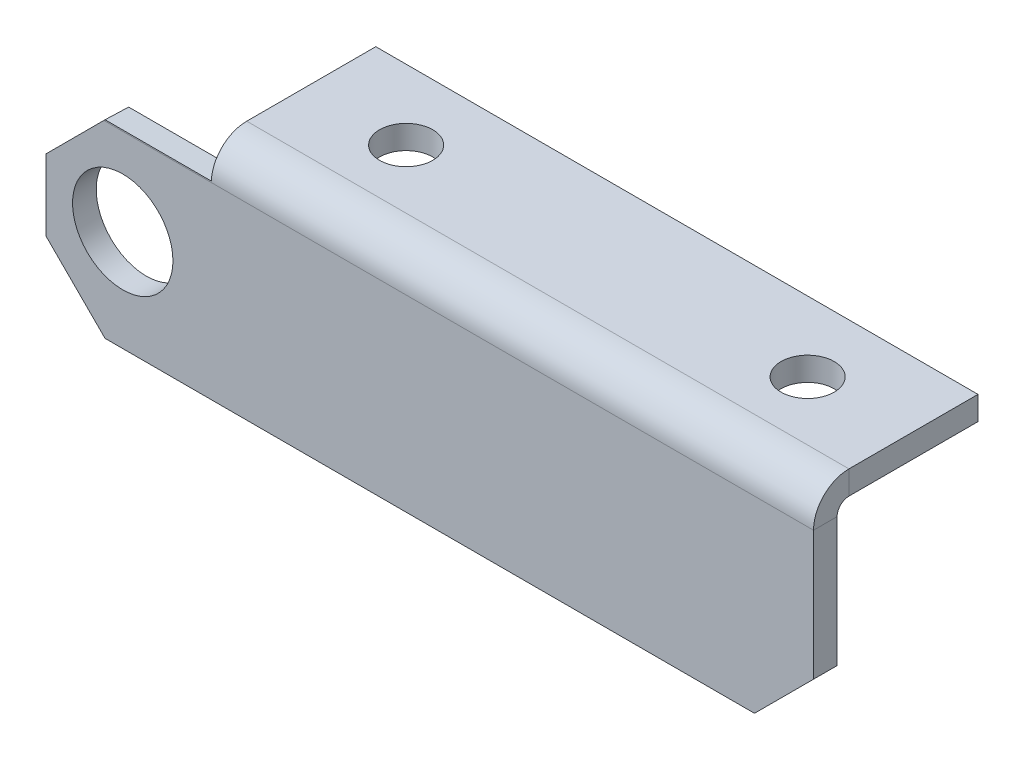
ISO-10303-21;
HEADER;
FILE_DESCRIPTION(('STEP AP214'),'2;1');
FILE_NAME('part.step','',(''),(''),'','','');
FILE_SCHEMA(('AUTOMOTIVE_DESIGN { 1 0 10303 214 1 1 1 1 }'));
ENDSEC;
DATA;
#1=APPLICATION_CONTEXT('core data for automotive mechanical design processes');
#2=APPLICATION_PROTOCOL_DEFINITION('international standard','automotive_design',2000,#1);
#3=PRODUCT_CONTEXT('',#1,'mechanical');
#4=PRODUCT('Part','Part','',(#3));
#5=PRODUCT_RELATED_PRODUCT_CATEGORY('part','',(#4));
#6=PRODUCT_DEFINITION_FORMATION('','',#4);
#7=PRODUCT_DEFINITION_CONTEXT('part definition',#1,'design');
#8=PRODUCT_DEFINITION('design','',#6,#7);
#9=PRODUCT_DEFINITION_SHAPE('','',#8);
#10=(LENGTH_UNIT() NAMED_UNIT(*) SI_UNIT(.MILLI.,.METRE.));
#11=(NAMED_UNIT(*) PLANE_ANGLE_UNIT() SI_UNIT($,.RADIAN.));
#12=(NAMED_UNIT(*) SI_UNIT($,.STERADIAN.) SOLID_ANGLE_UNIT());
#13=UNCERTAINTY_MEASURE_WITH_UNIT(LENGTH_MEASURE(1.E-05),#10,'distance_accuracy_value','');
#14=(GEOMETRIC_REPRESENTATION_CONTEXT(3) GLOBAL_UNCERTAINTY_ASSIGNED_CONTEXT((#13)) GLOBAL_UNIT_ASSIGNED_CONTEXT((#10,
#11,#12)) REPRESENTATION_CONTEXT('',''));
#15=CARTESIAN_POINT('',(0.,0.,0.));
#16=DIRECTION('',(0.,0.,1.));
#17=DIRECTION('',(1.,0.,0.));
#18=AXIS2_PLACEMENT_3D('',#15,#16,#17);
#19=CARTESIAN_POINT('',(0.,18.9292036732052,18.0707963267949));
#20=DIRECTION('',(0.,1.,0.));
#21=DIRECTION('',(1.,0.,0.));
#22=AXIS2_PLACEMENT_3D('',#19,#20,#21);
#23=PLANE('',#22);
#24=CARTESIAN_POINT('',(22.5,18.9292036732052,-6.00000000000007));
#25=DIRECTION('',(0.,-1.,0.));
#26=DIRECTION('',(0.,0.,-1.));
#27=AXIS2_PLACEMENT_3D('',#24,#25,#26);
#28=CIRCLE('',#27,2.25);
#29=CARTESIAN_POINT('',(22.5,18.9292036732052,-8.25000000000007));
#30=VERTEX_POINT('',#29);
#31=EDGE_CURVE('E473',#30,#30,#28,.T.);
#32=ORIENTED_EDGE('',*,*,#31,.T.);
#33=EDGE_LOOP('',(#32));
#34=FACE_BOUND('',#33,.T.);
#35=CARTESIAN_POINT('',(56.5000000000001,18.9292036732052,-5.99999999999995));
#36=DIRECTION('',(0.,-1.,0.));
#37=DIRECTION('',(0.,0.,-1.));
#38=AXIS2_PLACEMENT_3D('',#35,#36,#37);
#39=CIRCLE('',#38,2.25);
#40=CARTESIAN_POINT('',(56.5000000000001,18.9292036732051,-8.24999999999995));
#41=VERTEX_POINT('',#40);
#42=EDGE_CURVE('E468',#41,#41,#39,.T.);
#43=ORIENTED_EDGE('',*,*,#42,.T.);
#44=EDGE_LOOP('',(#43));
#45=FACE_BOUND('',#44,.T.);
#46=DIRECTION('',(0.,0.,1.));
#47=VECTOR('',#46,1.);
#48=CARTESIAN_POINT('',(14.,18.9292036732051,-11.9292036732051));
#49=LINE('',#48,#47);
#50=CARTESIAN_POINT('',(14.,18.9292036732051,-11.9292036732051));
#51=VERTEX_POINT('',#50);
#52=CARTESIAN_POINT('',(14.,18.9292036732051,-1.00000000000001));
#53=VERTEX_POINT('',#52);
#54=EDGE_CURVE('E196',#51,#53,#49,.T.);
#55=ORIENTED_EDGE('',*,*,#54,.T.);
#56=DIRECTION('',(1.,0.,0.));
#57=VECTOR('',#56,1.);
#58=CARTESIAN_POINT('',(0.,18.9292036732051,-1.00000000000001));
#59=LINE('',#58,#57);
#60=CARTESIAN_POINT('',(65.0000000000001,18.9292036732052,-0.99999999999989));
#61=VERTEX_POINT('',#60);
#62=EDGE_CURVE('E209',#53,#61,#59,.T.);
#63=ORIENTED_EDGE('',*,*,#62,.T.);
#64=DIRECTION('',(0.,0.,-1.));
#65=VECTOR('',#64,1.);
#66=CARTESIAN_POINT('',(65.0000000000001,18.9292036732052,18.0707963267949));
#67=LINE('',#66,#65);
#68=CARTESIAN_POINT('',(65.0000000000001,18.9292036732051,-11.929203673205));
#69=VERTEX_POINT('',#68);
#70=EDGE_CURVE('E192',#61,#69,#67,.T.);
#71=ORIENTED_EDGE('',*,*,#70,.T.);
#72=DIRECTION('',(-1.,0.,0.));
#73=VECTOR('',#72,1.);
#74=CARTESIAN_POINT('',(65.0000000000001,18.9292036732051,-11.929203673205));
#75=LINE('',#74,#73);
#76=EDGE_CURVE('E194',#69,#51,#75,.T.);
#77=ORIENTED_EDGE('',*,*,#76,.T.);
#78=EDGE_LOOP('',(#55,#63,#71,#77));
#79=FACE_BOUND('',#78,.T.);
#80=ADVANCED_FACE('F30',(#34,#45,#79),#23,.T.);
#81=CARTESIAN_POINT('',(65.0000000000001,18.9292036732052,18.0707963267949));
#82=DIRECTION('',(-1.,0.,0.));
#83=DIRECTION('',(0.,1.,0.));
#84=AXIS2_PLACEMENT_3D('',#81,#82,#83);
#85=PLANE('',#84);
#86=DIRECTION('',(0.,1.,0.));
#87=VECTOR('',#86,1.);
#88=CARTESIAN_POINT('',(65.0000000000001,18.9292036732052,-0.99999999999989));
#89=LINE('',#88,#87);
#90=CARTESIAN_POINT('',(65.,16.9292036732052,-0.999999999999918));
#91=VERTEX_POINT('',#90);
#92=EDGE_CURVE('E205',#91,#61,#89,.T.);
#93=ORIENTED_EDGE('',*,*,#92,.F.);
#94=DIRECTION('',(0.,0.,-1.));
#95=VECTOR('',#94,1.);
#96=CARTESIAN_POINT('',(65.,16.9292036732052,18.070796326795));
#97=LINE('',#96,#95);
#98=CARTESIAN_POINT('',(65.0000000000001,16.9292036732051,-11.929203673205));
#99=VERTEX_POINT('',#98);
#100=EDGE_CURVE('E186',#91,#99,#97,.T.);
#101=ORIENTED_EDGE('',*,*,#100,.T.);
#102=DIRECTION('',(0.,-1.,0.));
#103=VECTOR('',#102,1.);
#104=CARTESIAN_POINT('',(65.0000000000001,18.9292036732051,-11.929203673205));
#105=LINE('',#104,#103);
#106=EDGE_CURVE('E202',#69,#99,#105,.T.);
#107=ORIENTED_EDGE('',*,*,#106,.F.);
#108=ORIENTED_EDGE('',*,*,#70,.F.);
#109=EDGE_LOOP('',(#93,#101,#107,#108));
#110=FACE_BOUND('',#109,.T.);
#111=ADVANCED_FACE('F32',(#110),#85,.F.);
#112=CARTESIAN_POINT('',(65.0000000000001,18.9292036732051,-11.929203673205));
#113=DIRECTION('',(0.,0.,1.));
#114=DIRECTION('',(1.,0.,0.));
#115=AXIS2_PLACEMENT_3D('',#112,#113,#114);
#116=PLANE('',#115);
#117=DIRECTION('',(-1.,0.,0.));
#118=VECTOR('',#117,1.);
#119=CARTESIAN_POINT('',(65.0000000000001,16.9292036732051,-11.929203673205));
#120=LINE('',#119,#118);
#121=CARTESIAN_POINT('',(14.,16.9292036732051,-11.9292036732051));
#122=VERTEX_POINT('',#121);
#123=EDGE_CURVE('E188',#99,#122,#120,.T.);
#124=ORIENTED_EDGE('',*,*,#123,.T.);
#125=DIRECTION('',(0.,-1.,0.));
#126=VECTOR('',#125,1.);
#127=CARTESIAN_POINT('',(14.,18.9292036732051,-11.9292036732051));
#128=LINE('',#127,#126);
#129=EDGE_CURVE('E199',#51,#122,#128,.T.);
#130=ORIENTED_EDGE('',*,*,#129,.F.);
#131=ORIENTED_EDGE('',*,*,#76,.F.);
#132=ORIENTED_EDGE('',*,*,#106,.T.);
#133=EDGE_LOOP('',(#124,#130,#131,#132));
#134=FACE_BOUND('',#133,.T.);
#135=ADVANCED_FACE('F261',(#134),#116,.F.);
#136=CARTESIAN_POINT('',(14.,18.9292036732051,-11.9292036732051));
#137=DIRECTION('',(1.,0.,0.));
#138=DIRECTION('',(0.,0.,-1.));
#139=AXIS2_PLACEMENT_3D('',#136,#137,#138);
#140=PLANE('',#139);
#141=DIRECTION('',(0.,-1.,0.));
#142=VECTOR('',#141,1.);
#143=CARTESIAN_POINT('',(14.,18.9292036732051,-1.00000000000001));
#144=LINE('',#143,#142);
#145=CARTESIAN_POINT('',(14.,16.9292036732051,-1.00000000000004));
#146=VERTEX_POINT('',#145);
#147=EDGE_CURVE('E152',#53,#146,#144,.T.);
#148=ORIENTED_EDGE('',*,*,#147,.F.);
#149=ORIENTED_EDGE('',*,*,#54,.F.);
#150=ORIENTED_EDGE('',*,*,#129,.T.);
#151=DIRECTION('',(0.,0.,1.));
#152=VECTOR('',#151,1.);
#153=CARTESIAN_POINT('',(14.,16.9292036732051,-11.9292036732051));
#154=LINE('',#153,#152);
#155=EDGE_CURVE('E190',#122,#146,#154,.T.);
#156=ORIENTED_EDGE('',*,*,#155,.T.);
#157=EDGE_LOOP('',(#148,#149,#150,#156));
#158=FACE_BOUND('',#157,.T.);
#159=ADVANCED_FACE('F305',(#158),#140,.F.);
#160=CARTESIAN_POINT('',(0.,16.9292036732052,18.0707963267949));
#161=DIRECTION('',(0.,1.,0.));
#162=DIRECTION('',(1.,0.,0.));
#163=AXIS2_PLACEMENT_3D('',#160,#161,#162);
#164=PLANE('',#163);
#165=CARTESIAN_POINT('',(22.5,16.9292036732051,-6.00000000000007));
#166=DIRECTION('',(0.,-1.,0.));
#167=DIRECTION('',(0.,0.,-1.));
#168=AXIS2_PLACEMENT_3D('',#165,#166,#167);
#169=CIRCLE('',#168,2.25);
#170=CARTESIAN_POINT('',(22.5,16.9292036732051,-8.25000000000007));
#171=VERTEX_POINT('',#170);
#172=EDGE_CURVE('E477',#171,#171,#169,.T.);
#173=ORIENTED_EDGE('',*,*,#172,.F.);
#174=EDGE_LOOP('',(#173));
#175=FACE_BOUND('',#174,.T.);
#176=CARTESIAN_POINT('',(56.5000000000001,16.9292036732051,-5.99999999999998));
#177=DIRECTION('',(0.,-1.,0.));
#178=DIRECTION('',(0.,0.,-1.));
#179=AXIS2_PLACEMENT_3D('',#176,#177,#178);
#180=CIRCLE('',#179,2.25);
#181=CARTESIAN_POINT('',(56.5000000000001,16.9292036732051,-8.24999999999998));
#182=VERTEX_POINT('',#181);
#183=EDGE_CURVE('E471',#182,#182,#180,.T.);
#184=ORIENTED_EDGE('',*,*,#183,.F.);
#185=EDGE_LOOP('',(#184));
#186=FACE_BOUND('',#185,.T.);
#187=DIRECTION('',(1.,0.,0.));
#188=VECTOR('',#187,1.);
#189=CARTESIAN_POINT('',(0.,16.9292036732051,-1.));
#190=LINE('',#189,#188);
#191=EDGE_CURVE('E211',#146,#91,#190,.T.);
#192=ORIENTED_EDGE('',*,*,#191,.F.);
#193=ORIENTED_EDGE('',*,*,#155,.F.);
#194=ORIENTED_EDGE('',*,*,#123,.F.);
#195=ORIENTED_EDGE('',*,*,#100,.F.);
#196=EDGE_LOOP('',(#192,#193,#194,#195));
#197=FACE_BOUND('',#196,.T.);
#198=ADVANCED_FACE('F254',(#175,#186,#197),#164,.F.);
#199=CARTESIAN_POINT('',(0.,16.,2.));
#200=DIRECTION('',(1.,0.,0.));
#201=DIRECTION('',(0.,1.,0.));
#202=AXIS2_PLACEMENT_3D('',#199,#200,#201);
#203=PLANE('',#202);
#204=DIRECTION('',(0.,-1.,0.));
#205=VECTOR('',#204,1.);
#206=CARTESIAN_POINT('',(0.,16.,2.));
#207=LINE('',#206,#205);
#208=CARTESIAN_POINT('',(0.,11.0323083293317,2.00000000000009));
#209=VERTEX_POINT('',#208);
#210=CARTESIAN_POINT('',(0.,5.00000000000004,2.00000000000009));
#211=VERTEX_POINT('',#210);
#212=EDGE_CURVE('E170',#209,#211,#207,.T.);
#213=ORIENTED_EDGE('',*,*,#212,.F.);
#214=DIRECTION('',(0.,-0.0353907713673031,-0.999373550431483));
#215=VECTOR('',#214,1.);
#216=CARTESIAN_POINT('',(0.,10.967726692415,0.176327407268084));
#217=LINE('',#216,#215);
#218=CARTESIAN_POINT('',(0.,10.9614824177354,0.));
#219=VERTEX_POINT('',#218);
#220=EDGE_CURVE('E223',#209,#219,#217,.T.);
#221=ORIENTED_EDGE('',*,*,#220,.T.);
#222=DIRECTION('',(0.,-1.,0.));
#223=VECTOR('',#222,1.);
#224=CARTESIAN_POINT('',(0.,16.,0.));
#225=LINE('',#224,#223);
#226=CARTESIAN_POINT('',(0.,5.00000000000005,0.));
#227=VERTEX_POINT('',#226);
#228=EDGE_CURVE('E137',#219,#227,#225,.T.);
#229=ORIENTED_EDGE('',*,*,#228,.T.);
#230=DIRECTION('',(0.,0.,1.));
#231=VECTOR('',#230,1.);
#232=CARTESIAN_POINT('',(0.,5.00000000000006,2.00000000000009));
#233=LINE('',#232,#231);
#234=EDGE_CURVE('E221',#227,#211,#233,.T.);
#235=ORIENTED_EDGE('',*,*,#234,.T.);
#236=EDGE_LOOP('',(#213,#221,#229,#235));
#237=FACE_BOUND('',#236,.T.);
#238=ADVANCED_FACE('F277',(#237),#203,.F.);
#239=CARTESIAN_POINT('',(65.0000000000001,0.,2.));
#240=DIRECTION('',(-1.,0.,0.));
#241=DIRECTION('',(0.,0.,1.));
#242=AXIS2_PLACEMENT_3D('',#239,#240,#241);
#243=PLANE('',#242);
#244=DIRECTION('',(0.,1.,0.));
#245=VECTOR('',#244,1.);
#246=CARTESIAN_POINT('',(65.0000000000001,0.,2.));
#247=LINE('',#246,#245);
#248=CARTESIAN_POINT('',(65.0000000000001,5.00000000000001,2.));
#249=VERTEX_POINT('',#248);
#250=CARTESIAN_POINT('',(65.0000000000001,15.9292036732051,2.00000000000009));
#251=VERTEX_POINT('',#250);
#252=EDGE_CURVE('E175',#249,#251,#247,.T.);
#253=ORIENTED_EDGE('',*,*,#252,.F.);
#254=DIRECTION('',(0.,0.,-1.));
#255=VECTOR('',#254,1.);
#256=CARTESIAN_POINT('',(65.0000000000001,5.00000000000001,2.));
#257=LINE('',#256,#255);
#258=CARTESIAN_POINT('',(65.0000000000001,5.,0.));
#259=VERTEX_POINT('',#258);
#260=EDGE_CURVE('E233',#249,#259,#257,.T.);
#261=ORIENTED_EDGE('',*,*,#260,.T.);
#262=DIRECTION('',(0.,1.,0.));
#263=VECTOR('',#262,1.);
#264=CARTESIAN_POINT('',(65.0000000000001,0.,0.));
#265=LINE('',#264,#263);
#266=CARTESIAN_POINT('',(65.0000000000001,15.9292036732052,0.));
#267=VERTEX_POINT('',#266);
#268=EDGE_CURVE('E168',#259,#267,#265,.T.);
#269=ORIENTED_EDGE('',*,*,#268,.T.);
#270=DIRECTION('',(0.,0.,1.));
#271=VECTOR('',#270,1.);
#272=CARTESIAN_POINT('',(65.0000000000001,15.9292036732051,2.00000000000009));
#273=LINE('',#272,#271);
#274=EDGE_CURVE('E180',#267,#251,#273,.T.);
#275=ORIENTED_EDGE('',*,*,#274,.T.);
#276=EDGE_LOOP('',(#253,#261,#269,#275));
#277=FACE_BOUND('',#276,.T.);
#278=ADVANCED_FACE('F239',(#277),#243,.F.);
#279=CARTESIAN_POINT('',(0.,0.,0.));
#280=DIRECTION('',(0.,0.,1.));
#281=DIRECTION('',(1.,0.,0.));
#282=AXIS2_PLACEMENT_3D('',#279,#280,#281);
#283=PLANE('',#282);
#284=CARTESIAN_POINT('',(6.50000000000001,8.5592036732051,0.));
#285=DIRECTION('',(0.,0.,1.));
#286=DIRECTION('',(1.,0.,0.));
#287=AXIS2_PLACEMENT_3D('',#284,#285,#286);
#288=CIRCLE('',#287,4.25);
#289=CARTESIAN_POINT('',(10.75,8.5592036732051,0.));
#290=VERTEX_POINT('',#289);
#291=EDGE_CURVE('E148',#290,#290,#288,.T.);
#292=ORIENTED_EDGE('',*,*,#291,.T.);
#293=EDGE_LOOP('',(#292));
#294=FACE_BOUND('',#293,.T.);
#295=ORIENTED_EDGE('',*,*,#268,.F.);
#296=DIRECTION('',(0.707106781186549,0.707106781186547,0.));
#297=VECTOR('',#296,1.);
#298=CARTESIAN_POINT('',(65.0000000000001,5.00000000000001,0.));
#299=LINE('',#298,#297);
#300=CARTESIAN_POINT('',(60.0000000000001,0.,0.));
#301=VERTEX_POINT('',#300);
#302=EDGE_CURVE('E52',#259,#301,#299,.F.);
#303=ORIENTED_EDGE('',*,*,#302,.T.);
#304=DIRECTION('',(1.,0.,0.));
#305=VECTOR('',#304,1.);
#306=CARTESIAN_POINT('',(0.,0.,0.));
#307=LINE('',#306,#305);
#308=CARTESIAN_POINT('',(5.00000000000009,0.,0.));
#309=VERTEX_POINT('',#308);
#310=EDGE_CURVE('E166',#309,#301,#307,.T.);
#311=ORIENTED_EDGE('',*,*,#310,.F.);
#312=DIRECTION('',(0.707106781186552,-0.707106781186544,0.));
#313=VECTOR('',#312,1.);
#314=CARTESIAN_POINT('',(5.00000000000009,0.,0.));
#315=LINE('',#314,#313);
#316=EDGE_CURVE('E225',#309,#227,#315,.F.);
#317=ORIENTED_EDGE('',*,*,#316,.T.);
#318=ORIENTED_EDGE('',*,*,#228,.F.);
#319=DIRECTION('',(0.706885193723847,0.707328299231693,0.));
#320=VECTOR('',#319,1.);
#321=CARTESIAN_POINT('',(5.01768428999612,15.9823120042595,0.));
#322=LINE('',#321,#320);
#323=CARTESIAN_POINT('',(4.96460922863278,15.9292036732051,0.));
#324=VERTEX_POINT('',#323);
#325=EDGE_CURVE('E227',#219,#324,#322,.T.);
#326=ORIENTED_EDGE('',*,*,#325,.T.);
#327=DIRECTION('',(1.,0.,0.));
#328=VECTOR('',#327,1.);
#329=CARTESIAN_POINT('',(0.,15.9292036732051,0.));
#330=LINE('',#329,#328);
#331=EDGE_CURVE('E177',#324,#267,#330,.T.);
#332=ORIENTED_EDGE('',*,*,#331,.T.);
#333=EDGE_LOOP('',(#295,#303,#311,#317,#318,#326,#332));
#334=FACE_BOUND('',#333,.T.);
#335=ADVANCED_FACE('F242',(#294,#334),#283,.F.);
#336=CARTESIAN_POINT('',(0.,0.,2.));
#337=DIRECTION('',(0.,1.,0.));
#338=DIRECTION('',(0.,0.,1.));
#339=AXIS2_PLACEMENT_3D('',#336,#337,#338);
#340=PLANE('',#339);
#341=ORIENTED_EDGE('',*,*,#310,.T.);
#342=DIRECTION('',(0.,0.,1.));
#343=VECTOR('',#342,1.);
#344=CARTESIAN_POINT('',(60.0000000000001,0.,2.));
#345=LINE('',#344,#343);
#346=CARTESIAN_POINT('',(60.0000000000001,0.,2.));
#347=VERTEX_POINT('',#346);
#348=EDGE_CURVE('E38',#301,#347,#345,.T.);
#349=ORIENTED_EDGE('',*,*,#348,.T.);
#350=DIRECTION('',(1.,0.,0.));
#351=VECTOR('',#350,1.);
#352=CARTESIAN_POINT('',(0.,0.,2.));
#353=LINE('',#352,#351);
#354=CARTESIAN_POINT('',(5.00000000000009,0.,2.));
#355=VERTEX_POINT('',#354);
#356=EDGE_CURVE('E173',#355,#347,#353,.T.);
#357=ORIENTED_EDGE('',*,*,#356,.F.);
#358=DIRECTION('',(0.,0.,-1.));
#359=VECTOR('',#358,1.);
#360=CARTESIAN_POINT('',(5.00000000000009,0.,2.));
#361=LINE('',#360,#359);
#362=EDGE_CURVE('E230',#355,#309,#361,.T.);
#363=ORIENTED_EDGE('',*,*,#362,.T.);
#364=EDGE_LOOP('',(#341,#349,#357,#363));
#365=FACE_BOUND('',#364,.T.);
#366=ADVANCED_FACE('F283',(#365),#340,.F.);
#367=CARTESIAN_POINT('',(0.,0.,2.));
#368=DIRECTION('',(0.,0.,1.));
#369=DIRECTION('',(1.,0.,0.));
#370=AXIS2_PLACEMENT_3D('',#367,#368,#369);
#371=PLANE('',#370);
#372=CARTESIAN_POINT('',(6.50000000000001,8.55920367320512,2.00000000000009));
#373=DIRECTION('',(0.,0.,1.));
#374=DIRECTION('',(1.,0.,0.));
#375=AXIS2_PLACEMENT_3D('',#372,#373,#374);
#376=CIRCLE('',#375,4.25);
#377=CARTESIAN_POINT('',(10.75,8.55920367320512,2.00000000000008));
#378=VERTEX_POINT('',#377);
#379=EDGE_CURVE('E475',#378,#378,#376,.T.);
#380=ORIENTED_EDGE('',*,*,#379,.F.);
#381=EDGE_LOOP('',(#380));
#382=FACE_BOUND('',#381,.T.);
#383=ORIENTED_EDGE('',*,*,#356,.T.);
#384=DIRECTION('',(-0.707106781186549,-0.707106781186547,0.));
#385=VECTOR('',#384,1.);
#386=CARTESIAN_POINT('',(29.9999999999999,-30.,2.00000000000009));
#387=LINE('',#386,#385);
#388=EDGE_CURVE('E11',#347,#249,#387,.F.);
#389=ORIENTED_EDGE('',*,*,#388,.T.);
#390=ORIENTED_EDGE('',*,*,#252,.T.);
#391=DIRECTION('',(1.,0.,0.));
#392=VECTOR('',#391,1.);
#393=CARTESIAN_POINT('',(0.,15.9292036732051,2.));
#394=LINE('',#393,#392);
#395=CARTESIAN_POINT('',(4.89382768589818,15.9292036732051,2.));
#396=VERTEX_POINT('',#395);
#397=EDGE_CURVE('E183',#396,#251,#394,.T.);
#398=ORIENTED_EDGE('',*,*,#397,.F.);
#399=DIRECTION('',(-0.706885193723847,-0.707328299231693,0.));
#400=VECTOR('',#399,1.);
#401=CARTESIAN_POINT('',(-5.51615308161043,5.51269748989264,2.));
#402=LINE('',#401,#400);
#403=EDGE_CURVE('E219',#396,#209,#402,.T.);
#404=ORIENTED_EDGE('',*,*,#403,.T.);
#405=ORIENTED_EDGE('',*,*,#212,.T.);
#406=DIRECTION('',(-0.707106781186552,0.707106781186544,0.));
#407=VECTOR('',#406,1.);
#408=CARTESIAN_POINT('',(2.50000000000003,2.50000000000006,2.));
#409=LINE('',#408,#407);
#410=EDGE_CURVE('E217',#211,#355,#409,.F.);
#411=ORIENTED_EDGE('',*,*,#410,.T.);
#412=EDGE_LOOP('',(#383,#389,#390,#398,#404,#405,#411));
#413=FACE_BOUND('',#412,.T.);
#414=ADVANCED_FACE('F271',(#382,#413),#371,.T.);
#415=CARTESIAN_POINT('',(14.,15.9292036732051,-1.));
#416=DIRECTION('',(-1.,0.,0.));
#417=DIRECTION('',(0.,0.,1.));
#418=AXIS2_PLACEMENT_3D('',#415,#416,#417);
#419=PLANE('',#418);
#420=ORIENTED_EDGE('',*,*,#147,.T.);
#421=CARTESIAN_POINT('',(14.,15.9292036732051,-1.));
#422=DIRECTION('',(1.,0.,0.));
#423=DIRECTION('',(0.,1.,0.));
#424=AXIS2_PLACEMENT_3D('',#421,#422,#423);
#425=CIRCLE('',#424,1.);
#426=CARTESIAN_POINT('',(14.,15.9645944445724,-0.000626449568510989));
#427=VERTEX_POINT('',#426);
#428=EDGE_CURVE('E145',#146,#427,#425,.T.);
#429=ORIENTED_EDGE('',*,*,#428,.T.);
#430=DIRECTION('',(0.,0.0353907713673052,0.999373550431483));
#431=VECTOR('',#430,1.);
#432=CARTESIAN_POINT('',(14.,15.9999852159397,0.998747100862965));
#433=LINE('',#432,#431);
#434=CARTESIAN_POINT('',(14.,16.035375987307,1.99812065129445));
#435=VERTEX_POINT('',#434);
#436=EDGE_CURVE('E125',#427,#435,#433,.T.);
#437=ORIENTED_EDGE('',*,*,#436,.T.);
#438=CARTESIAN_POINT('',(14.,15.9292036732051,-1.));
#439=DIRECTION('',(1.,0.,0.));
#440=DIRECTION('',(0.,1.,0.));
#441=AXIS2_PLACEMENT_3D('',#438,#439,#440);
#442=CIRCLE('',#441,3.);
#443=EDGE_CURVE('E160',#53,#435,#442,.T.);
#444=ORIENTED_EDGE('',*,*,#443,.F.);
#445=EDGE_LOOP('',(#420,#429,#437,#444));
#446=FACE_BOUND('',#445,.T.);
#447=ADVANCED_FACE('F151',(#446),#419,.T.);
#448=CARTESIAN_POINT('',(7.00000000000001,15.9999852159397,0.998747100862965));
#449=DIRECTION('',(0.,0.999373550431483,-0.0353907713673031));
#450=DIRECTION('',(-1.,0.,0.));
#451=AXIS2_PLACEMENT_3D('',#448,#449,#450);
#452=PLANE('',#451);
#453=DIRECTION('',(1.,0.,0.));
#454=VECTOR('',#453,1.);
#455=CARTESIAN_POINT('',(-57.6170370791756,15.9645944445724,-0.000626449568469356));
#456=LINE('',#455,#454);
#457=CARTESIAN_POINT('',(5.00000000000008,15.9645944445724,-0.000626449568510989));
#458=VERTEX_POINT('',#457);
#459=EDGE_CURVE('E129',#427,#458,#456,.F.);
#460=ORIENTED_EDGE('',*,*,#459,.T.);
#461=DIRECTION('',(0.,0.0353907713673032,0.999373550431483));
#462=VECTOR('',#461,1.);
#463=CARTESIAN_POINT('',(5.00000000000009,16.035375987307,1.99812065129445));
#464=LINE('',#463,#462);
#465=CARTESIAN_POINT('',(5.00000000000007,16.035375987307,1.99812065129445));
#466=VERTEX_POINT('',#465);
#467=EDGE_CURVE('E213',#458,#466,#464,.T.);
#468=ORIENTED_EDGE('',*,*,#467,.T.);
#469=DIRECTION('',(1.,0.,0.));
#470=VECTOR('',#469,1.);
#471=CARTESIAN_POINT('',(-57.6170370791756,16.035375987307,1.9981206512945));
#472=LINE('',#471,#470);
#473=EDGE_CURVE('E132',#435,#466,#472,.F.);
#474=ORIENTED_EDGE('',*,*,#473,.F.);
#475=ORIENTED_EDGE('',*,*,#436,.F.);
#476=EDGE_LOOP('',(#460,#468,#474,#475));
#477=FACE_BOUND('',#476,.T.);
#478=ADVANCED_FACE('F127',(#477),#452,.T.);
#479=CARTESIAN_POINT('',(65.0000000000001,15.9292036732052,-0.999999999999918));
#480=DIRECTION('',(1.,0.,0.));
#481=DIRECTION('',(0.,0.,-1.));
#482=AXIS2_PLACEMENT_3D('',#479,#480,#481);
#483=PLANE('',#482);
#484=CARTESIAN_POINT('',(65.0000000000001,15.9292036732052,-0.999999999999918));
#485=DIRECTION('',(1.,0.,0.));
#486=DIRECTION('',(0.,1.,0.));
#487=AXIS2_PLACEMENT_3D('',#484,#485,#486);
#488=CIRCLE('',#487,1.);
#489=EDGE_CURVE('E153',#267,#91,#488,.F.);
#490=ORIENTED_EDGE('',*,*,#489,.T.);
#491=ORIENTED_EDGE('',*,*,#92,.T.);
#492=CARTESIAN_POINT('',(65.0000000000001,15.9292036732052,-0.999999999999918));
#493=DIRECTION('',(1.,0.,0.));
#494=DIRECTION('',(0.,1.,0.));
#495=AXIS2_PLACEMENT_3D('',#492,#493,#494);
#496=CIRCLE('',#495,3.);
#497=EDGE_CURVE('E138',#251,#61,#496,.F.);
#498=ORIENTED_EDGE('',*,*,#497,.F.);
#499=ORIENTED_EDGE('',*,*,#274,.F.);
#500=EDGE_LOOP('',(#490,#491,#498,#499));
#501=FACE_BOUND('',#500,.T.);
#502=ADVANCED_FACE('F249',(#501),#483,.T.);
#503=CARTESIAN_POINT('',(-57.6170370791756,15.9292036732051,-0.999999999999959));
#504=DIRECTION('',(1.,0.,0.));
#505=DIRECTION('',(0.,1.,0.));
#506=AXIS2_PLACEMENT_3D('',#503,#504,#505);
#507=CYLINDRICAL_SURFACE('',#506,3.);
#508=ORIENTED_EDGE('',*,*,#473,.T.);
#509=CARTESIAN_POINT('',(5.00000000000008,15.9292036732051,-1.));
#510=DIRECTION('',(-0.707106781186545,0.706663814448581,-0.0250250544252428));
#511=DIRECTION('',(0.707106781186552,0.706663814448574,-0.0250250544252426));
#512=AXIS2_PLACEMENT_3D('',#509,#510,#511);
#513=ELLIPSE('',#512,4.24264068711931,3.);
#514=EDGE_CURVE('E215',#466,#396,#513,.F.);
#515=ORIENTED_EDGE('',*,*,#514,.T.);
#516=ORIENTED_EDGE('',*,*,#397,.T.);
#517=ORIENTED_EDGE('',*,*,#497,.T.);
#518=ORIENTED_EDGE('',*,*,#62,.F.);
#519=ORIENTED_EDGE('',*,*,#443,.T.);
#520=EDGE_LOOP('',(#508,#515,#516,#517,#518,#519));
#521=FACE_BOUND('',#520,.T.);
#522=ADVANCED_FACE('F267',(#521),#507,.T.);
#523=CARTESIAN_POINT('',(-57.6170370791756,15.9292036732051,-0.999999999999959));
#524=DIRECTION('',(1.,0.,0.));
#525=DIRECTION('',(0.,1.,0.));
#526=AXIS2_PLACEMENT_3D('',#523,#524,#525);
#527=CYLINDRICAL_SURFACE('',#526,1.);
#528=ORIENTED_EDGE('',*,*,#331,.F.);
#529=CARTESIAN_POINT('',(5.00000000000008,15.9292036732051,-1.));
#530=DIRECTION('',(-0.707106781186545,0.706663814448581,-0.0250250544252428));
#531=DIRECTION('',(0.707106781186552,0.706663814448574,-0.0250250544252426));
#532=AXIS2_PLACEMENT_3D('',#529,#530,#531);
#533=ELLIPSE('',#532,1.4142135623731,1.);
#534=EDGE_CURVE('E147',#324,#458,#533,.T.);
#535=ORIENTED_EDGE('',*,*,#534,.T.);
#536=ORIENTED_EDGE('',*,*,#459,.F.);
#537=ORIENTED_EDGE('',*,*,#428,.F.);
#538=ORIENTED_EDGE('',*,*,#191,.T.);
#539=ORIENTED_EDGE('',*,*,#489,.F.);
#540=EDGE_LOOP('',(#528,#535,#536,#537,#538,#539));
#541=FACE_BOUND('',#540,.T.);
#542=ADVANCED_FACE('F143',(#541),#527,.F.);
#543=CARTESIAN_POINT('',(5.00000000000009,15.9999852159397,0.998747100862965));
#544=DIRECTION('',(-0.707106781186545,0.706663814448581,-0.0250250544252428));
#545=DIRECTION('',(-0.706885193723847,-0.707328299231693,0.));
#546=AXIS2_PLACEMENT_3D('',#543,#544,#545);
#547=PLANE('',#546);
#548=ORIENTED_EDGE('',*,*,#325,.F.);
#549=ORIENTED_EDGE('',*,*,#220,.F.);
#550=ORIENTED_EDGE('',*,*,#403,.F.);
#551=ORIENTED_EDGE('',*,*,#514,.F.);
#552=ORIENTED_EDGE('',*,*,#467,.F.);
#553=ORIENTED_EDGE('',*,*,#534,.F.);
#554=EDGE_LOOP('',(#548,#549,#550,#551,#552,#553));
#555=FACE_BOUND('',#554,.T.);
#556=ADVANCED_FACE('F275',(#555),#547,.T.);
#557=CARTESIAN_POINT('',(5.00000000000009,0.,2.));
#558=DIRECTION('',(0.707106781186544,0.707106781186552,0.));
#559=DIRECTION('',(-0.707106781186552,0.707106781186544,0.));
#560=AXIS2_PLACEMENT_3D('',#557,#558,#559);
#561=PLANE('',#560);
#562=ORIENTED_EDGE('',*,*,#410,.F.);
#563=ORIENTED_EDGE('',*,*,#234,.F.);
#564=ORIENTED_EDGE('',*,*,#316,.F.);
#565=ORIENTED_EDGE('',*,*,#362,.F.);
#566=EDGE_LOOP('',(#562,#563,#564,#565));
#567=FACE_BOUND('',#566,.T.);
#568=ADVANCED_FACE('F282',(#567),#561,.F.);
#569=CARTESIAN_POINT('',(6.50000000000001,8.55920367320512,-11.929203673205));
#570=DIRECTION('',(0.,0.,1.));
#571=DIRECTION('',(1.,0.,0.));
#572=AXIS2_PLACEMENT_3D('',#569,#570,#571);
#573=CYLINDRICAL_SURFACE('',#572,4.25);
#574=ORIENTED_EDGE('',*,*,#379,.T.);
#575=EDGE_LOOP('',(#574));
#576=FACE_BOUND('',#575,.T.);
#577=ORIENTED_EDGE('',*,*,#291,.F.);
#578=EDGE_LOOP('',(#577));
#579=FACE_BOUND('',#578,.T.);
#580=ADVANCED_FACE('F396',(#576,#579),#573,.F.);
#581=CARTESIAN_POINT('',(56.5000000000001,18.9292036732052,-5.99999999999995));
#582=DIRECTION('',(0.,-1.,0.));
#583=DIRECTION('',(0.,0.,-1.));
#584=AXIS2_PLACEMENT_3D('',#581,#582,#583);
#585=CYLINDRICAL_SURFACE('',#584,2.25);
#586=ORIENTED_EDGE('',*,*,#42,.F.);
#587=EDGE_LOOP('',(#586));
#588=FACE_BOUND('',#587,.T.);
#589=ORIENTED_EDGE('',*,*,#183,.T.);
#590=EDGE_LOOP('',(#589));
#591=FACE_BOUND('',#590,.T.);
#592=ADVANCED_FACE('F291',(#588,#591),#585,.F.);
#593=CARTESIAN_POINT('',(22.5,18.9292036732052,-6.00000000000007));
#594=DIRECTION('',(0.,-1.,0.));
#595=DIRECTION('',(0.,0.,-1.));
#596=AXIS2_PLACEMENT_3D('',#593,#594,#595);
#597=CYLINDRICAL_SURFACE('',#596,2.25);
#598=ORIENTED_EDGE('',*,*,#31,.F.);
#599=EDGE_LOOP('',(#598));
#600=FACE_BOUND('',#599,.T.);
#601=ORIENTED_EDGE('',*,*,#172,.T.);
#602=EDGE_LOOP('',(#601));
#603=FACE_BOUND('',#602,.T.);
#604=ADVANCED_FACE('F286',(#600,#603),#597,.F.);
#605=CARTESIAN_POINT('',(65.0000000000001,5.00000000000001,2.));
#606=DIRECTION('',(-0.707106781186547,0.707106781186549,0.));
#607=DIRECTION('',(-0.707106781186549,-0.707106781186547,0.));
#608=AXIS2_PLACEMENT_3D('',#605,#606,#607);
#609=PLANE('',#608);
#610=ORIENTED_EDGE('',*,*,#388,.F.);
#611=ORIENTED_EDGE('',*,*,#348,.F.);
#612=ORIENTED_EDGE('',*,*,#302,.F.);
#613=ORIENTED_EDGE('',*,*,#260,.F.);
#614=EDGE_LOOP('',(#610,#611,#612,#613));
#615=FACE_BOUND('',#614,.T.);
#616=ADVANCED_FACE('F284',(#615),#609,.F.);
#617=CLOSED_SHELL('',(#80,#111,#135,#159,#198,#238,#278,#335,#366,#414,#447,#478,#502,#522,#542,
#556,#568,#580,#592,#604,#616));
#618=MANIFOLD_SOLID_BREP('B2',#617);
#619=ADVANCED_BREP_SHAPE_REPRESENTATION('',(#18,#618),#14);
#620=SHAPE_DEFINITION_REPRESENTATION(#9,#619);
ENDSEC;
END-ISO-10303-21;
